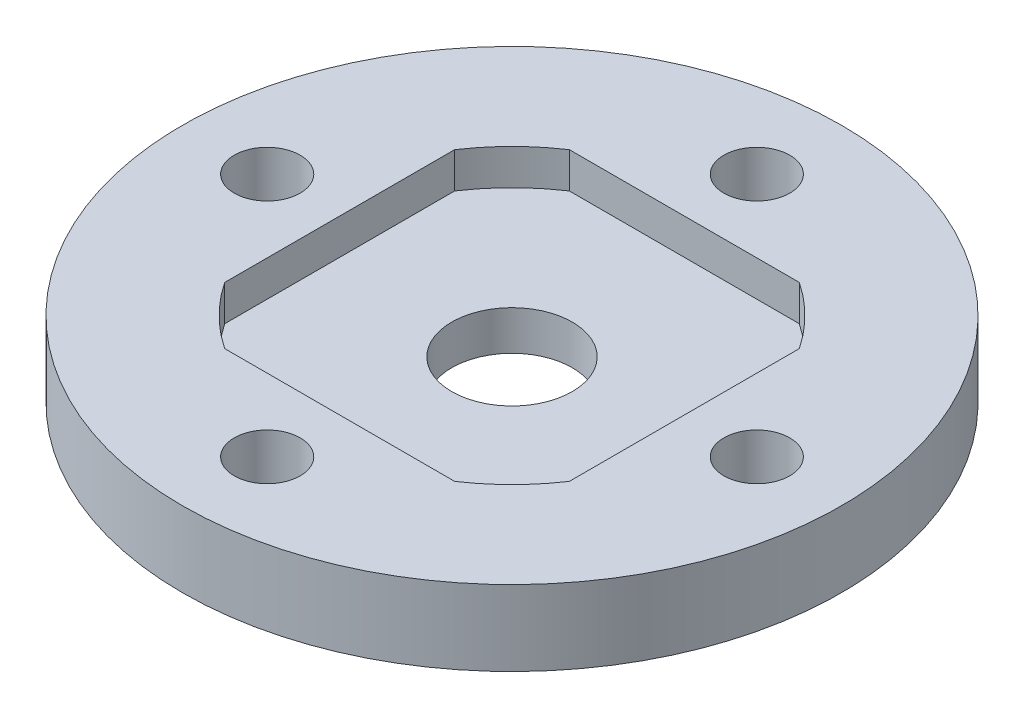
ISO-10303-21;
HEADER;
FILE_DESCRIPTION(('STEP AP214'),'2;1');
FILE_NAME('part.step','',(''),(''),'','','');
FILE_SCHEMA(('AUTOMOTIVE_DESIGN { 1 0 10303 214 1 1 1 1 }'));
ENDSEC;
DATA;
#1=APPLICATION_CONTEXT('core data for automotive mechanical design processes');
#2=APPLICATION_PROTOCOL_DEFINITION('international standard','automotive_design',2000,#1);
#3=PRODUCT_CONTEXT('',#1,'mechanical');
#4=PRODUCT('Part','Part','',(#3));
#5=PRODUCT_RELATED_PRODUCT_CATEGORY('part','',(#4));
#6=PRODUCT_DEFINITION_FORMATION('','',#4);
#7=PRODUCT_DEFINITION_CONTEXT('part definition',#1,'design');
#8=PRODUCT_DEFINITION('design','',#6,#7);
#9=PRODUCT_DEFINITION_SHAPE('','',#8);
#10=(LENGTH_UNIT() NAMED_UNIT(*) SI_UNIT(.MILLI.,.METRE.));
#11=(NAMED_UNIT(*) PLANE_ANGLE_UNIT() SI_UNIT($,.RADIAN.));
#12=(NAMED_UNIT(*) SI_UNIT($,.STERADIAN.) SOLID_ANGLE_UNIT());
#13=UNCERTAINTY_MEASURE_WITH_UNIT(LENGTH_MEASURE(1.E-05),#10,'distance_accuracy_value','');
#14=(GEOMETRIC_REPRESENTATION_CONTEXT(3) GLOBAL_UNCERTAINTY_ASSIGNED_CONTEXT((#13)) GLOBAL_UNIT_ASSIGNED_CONTEXT((#10,
#11,#12)) REPRESENTATION_CONTEXT('',''));
#15=CARTESIAN_POINT('',(0.,0.,0.));
#16=DIRECTION('',(0.,0.,1.));
#17=DIRECTION('',(1.,0.,0.));
#18=AXIS2_PLACEMENT_3D('',#15,#16,#17);
#19=CARTESIAN_POINT('',(0.106470277324355,0.,0.34151265619882));
#20=DIRECTION('',(0.,1.,0.));
#21=DIRECTION('',(0.,0.,1.));
#22=AXIS2_PLACEMENT_3D('',#19,#20,#21);
#23=CYLINDRICAL_SURFACE('',#22,3.2);
#24=CARTESIAN_POINT('',(0.106470277324355,0.,0.34151265619882));
#25=DIRECTION('',(0.,1.,0.));
#26=DIRECTION('',(0.,0.,1.));
#27=AXIS2_PLACEMENT_3D('',#24,#25,#26);
#28=CIRCLE('',#27,3.2);
#29=CARTESIAN_POINT('',(0.106470277324355,0.,3.54151265619882));
#30=VERTEX_POINT('',#29);
#31=EDGE_CURVE('E166',#30,#30,#28,.T.);
#32=ORIENTED_EDGE('',*,*,#31,.F.);
#33=EDGE_LOOP('',(#32));
#34=FACE_BOUND('',#33,.T.);
#35=CARTESIAN_POINT('',(0.106470277324355,2.1,0.34151265619882));
#36=DIRECTION('',(0.,1.,0.));
#37=DIRECTION('',(0.,0.,1.));
#38=AXIS2_PLACEMENT_3D('',#35,#36,#37);
#39=CIRCLE('',#38,3.2);
#40=CARTESIAN_POINT('',(0.106470277324355,2.1,3.54151265619882));
#41=VERTEX_POINT('',#40);
#42=EDGE_CURVE('E156',#41,#41,#39,.F.);
#43=ORIENTED_EDGE('',*,*,#42,.F.);
#44=EDGE_LOOP('',(#43));
#45=FACE_BOUND('',#44,.T.);
#46=ADVANCED_FACE('F35',(#34,#45),#23,.F.);
#47=CARTESIAN_POINT('',(0.106470277324355,4.,0.34151265619882));
#48=DIRECTION('',(0.,1.,0.));
#49=DIRECTION('',(0.,0.,1.));
#50=AXIS2_PLACEMENT_3D('',#47,#48,#49);
#51=PLANE('',#50);
#52=CARTESIAN_POINT('',(0.106470277324357,4.,0.34151265619882));
#53=DIRECTION('',(0.,1.,0.));
#54=DIRECTION('',(0.,0.,1.));
#55=AXIS2_PLACEMENT_3D('',#52,#53,#54);
#56=CIRCLE('',#55,11.);
#57=CARTESIAN_POINT('',(-9.04352972267564,4.,6.44704293619908));
#58=VERTEX_POINT('',#57);
#59=CARTESIAN_POINT('',(-5.9990600026759,4.,9.49151265619882));
#60=VERTEX_POINT('',#59);
#61=EDGE_CURVE('E50',#58,#60,#56,.T.);
#62=ORIENTED_EDGE('',*,*,#61,.F.);
#63=DIRECTION('',(0.,0.,1.));
#64=VECTOR('',#63,1.);
#65=CARTESIAN_POINT('',(-9.04352972267564,4.,-5.76401762380143));
#66=LINE('',#65,#64);
#67=CARTESIAN_POINT('',(-9.04352972267564,4.,-5.76401762380144));
#68=VERTEX_POINT('',#67);
#69=EDGE_CURVE('E152',#68,#58,#66,.T.);
#70=ORIENTED_EDGE('',*,*,#69,.F.);
#71=CARTESIAN_POINT('',(0.106470277324357,4.,0.34151265619882));
#72=DIRECTION('',(0.,1.,0.));
#73=DIRECTION('',(0.,0.,1.));
#74=AXIS2_PLACEMENT_3D('',#71,#72,#73);
#75=CIRCLE('',#74,11.);
#76=CARTESIAN_POINT('',(-5.9990600026759,4.,-8.80848734380118));
#77=VERTEX_POINT('',#76);
#78=EDGE_CURVE('E150',#77,#68,#75,.T.);
#79=ORIENTED_EDGE('',*,*,#78,.F.);
#80=DIRECTION('',(-1.,0.,0.));
#81=VECTOR('',#80,1.);
#82=CARTESIAN_POINT('',(6.21200055732461,4.,-8.80848734380118));
#83=LINE('',#82,#81);
#84=CARTESIAN_POINT('',(6.21200055732461,4.,-8.80848734380118));
#85=VERTEX_POINT('',#84);
#86=EDGE_CURVE('E110',#85,#77,#83,.T.);
#87=ORIENTED_EDGE('',*,*,#86,.F.);
#88=CARTESIAN_POINT('',(0.106470277324357,4.,0.34151265619882));
#89=DIRECTION('',(0.,1.,0.));
#90=DIRECTION('',(0.,0.,1.));
#91=AXIS2_PLACEMENT_3D('',#88,#89,#90);
#92=CIRCLE('',#91,11.);
#93=CARTESIAN_POINT('',(9.25647027732436,4.,-5.76401762380144));
#94=VERTEX_POINT('',#93);
#95=EDGE_CURVE('E146',#94,#85,#92,.T.);
#96=ORIENTED_EDGE('',*,*,#95,.F.);
#97=DIRECTION('',(0.,0.,-1.));
#98=VECTOR('',#97,1.);
#99=CARTESIAN_POINT('',(9.25647027732436,4.,-5.76401762380144));
#100=LINE('',#99,#98);
#101=CARTESIAN_POINT('',(9.25647027732436,4.,6.44704293619907));
#102=VERTEX_POINT('',#101);
#103=EDGE_CURVE('E143',#102,#94,#100,.T.);
#104=ORIENTED_EDGE('',*,*,#103,.F.);
#105=CARTESIAN_POINT('',(0.106470277324357,4.,0.34151265619882));
#106=DIRECTION('',(0.,1.,0.));
#107=DIRECTION('',(0.,0.,1.));
#108=AXIS2_PLACEMENT_3D('',#105,#106,#107);
#109=CIRCLE('',#108,11.);
#110=CARTESIAN_POINT('',(6.21200055732461,4.,9.49151265619882));
#111=VERTEX_POINT('',#110);
#112=EDGE_CURVE('E140',#111,#102,#109,.T.);
#113=ORIENTED_EDGE('',*,*,#112,.F.);
#114=DIRECTION('',(1.,0.,0.));
#115=VECTOR('',#114,1.);
#116=CARTESIAN_POINT('',(6.21200055732461,4.,9.49151265619882));
#117=LINE('',#116,#115);
#118=EDGE_CURVE('E137',#60,#111,#117,.T.);
#119=ORIENTED_EDGE('',*,*,#118,.F.);
#120=EDGE_LOOP('',(#62,#70,#79,#87,#96,#104,#113,#119));
#121=FACE_BOUND('',#120,.T.);
#122=CARTESIAN_POINT('',(-12.8935297226753,4.,0.341512656198451));
#123=DIRECTION('',(0.,1.,0.));
#124=DIRECTION('',(0.,0.,1.));
#125=AXIS2_PLACEMENT_3D('',#122,#123,#124);
#126=CIRCLE('',#125,1.75000000000059);
#127=CARTESIAN_POINT('',(-12.8935297226753,4.,2.09151265619904));
#128=VERTEX_POINT('',#127);
#129=EDGE_CURVE('E172',#128,#128,#126,.T.);
#130=ORIENTED_EDGE('',*,*,#129,.F.);
#131=EDGE_LOOP('',(#130));
#132=FACE_BOUND('',#131,.T.);
#133=CARTESIAN_POINT('',(13.1064702773247,4.,0.341512656199187));
#134=DIRECTION('',(0.,1.,0.));
#135=DIRECTION('',(0.,0.,1.));
#136=AXIS2_PLACEMENT_3D('',#133,#134,#135);
#137=CIRCLE('',#136,1.75000000000029);
#138=CARTESIAN_POINT('',(13.1064702773247,4.,2.09151265619948));
#139=VERTEX_POINT('',#138);
#140=EDGE_CURVE('E178',#139,#139,#137,.T.);
#141=ORIENTED_EDGE('',*,*,#140,.F.);
#142=EDGE_LOOP('',(#141));
#143=FACE_BOUND('',#142,.T.);
#144=CARTESIAN_POINT('',(0.106470277324355,4.,0.34151265619882));
#145=DIRECTION('',(0.,1.,0.));
#146=DIRECTION('',(0.,0.,1.));
#147=AXIS2_PLACEMENT_3D('',#144,#145,#146);
#148=CIRCLE('',#147,17.5);
#149=CARTESIAN_POINT('',(0.106470277324355,4.,17.8415126561988));
#150=VERTEX_POINT('',#149);
#151=EDGE_CURVE('E182',#150,#150,#148,.T.);
#152=ORIENTED_EDGE('',*,*,#151,.T.);
#153=EDGE_LOOP('',(#152));
#154=FACE_BOUND('',#153,.T.);
#155=CARTESIAN_POINT('',(0.106470277324355,4.,13.3415126561988));
#156=DIRECTION('',(0.,1.,0.));
#157=DIRECTION('',(0.,0.,1.));
#158=AXIS2_PLACEMENT_3D('',#155,#156,#157);
#159=CIRCLE('',#158,1.75);
#160=CARTESIAN_POINT('',(0.106470277324355,4.,15.0915126561988));
#161=VERTEX_POINT('',#160);
#162=EDGE_CURVE('E175',#161,#161,#159,.T.);
#163=ORIENTED_EDGE('',*,*,#162,.F.);
#164=EDGE_LOOP('',(#163));
#165=FACE_BOUND('',#164,.T.);
#166=CARTESIAN_POINT('',(0.106470277325091,4.,-12.6584873438012));
#167=DIRECTION('',(0.,1.,0.));
#168=DIRECTION('',(0.,0.,1.));
#169=AXIS2_PLACEMENT_3D('',#166,#167,#168);
#170=CIRCLE('',#169,1.75000000000079);
#171=CARTESIAN_POINT('',(0.106470277325091,4.,-10.9084873438004));
#172=VERTEX_POINT('',#171);
#173=EDGE_CURVE('E169',#172,#172,#170,.T.);
#174=ORIENTED_EDGE('',*,*,#173,.F.);
#175=EDGE_LOOP('',(#174));
#176=FACE_BOUND('',#175,.T.);
#177=ADVANCED_FACE('F222',(#121,#132,#143,#154,#165,#176),#51,.T.);
#178=CARTESIAN_POINT('',(0.106470277324355,0.,0.34151265619882));
#179=DIRECTION('',(0.,1.,0.));
#180=DIRECTION('',(0.,0.,1.));
#181=AXIS2_PLACEMENT_3D('',#178,#179,#180);
#182=PLANE('',#181);
#183=CARTESIAN_POINT('',(0.106470277324355,0.,13.3415126561988));
#184=DIRECTION('',(0.,1.,0.));
#185=DIRECTION('',(0.,0.,1.));
#186=AXIS2_PLACEMENT_3D('',#183,#184,#185);
#187=CIRCLE('',#186,3.14999999999999);
#188=CARTESIAN_POINT('',(0.106470277324355,0.,16.4915126561988));
#189=VERTEX_POINT('',#188);
#190=EDGE_CURVE('E198',#189,#189,#187,.T.);
#191=ORIENTED_EDGE('',*,*,#190,.T.);
#192=EDGE_LOOP('',(#191));
#193=FACE_BOUND('',#192,.T.);
#194=CARTESIAN_POINT('',(13.1064702773247,0.,0.341512656199187));
#195=DIRECTION('',(0.,1.,0.));
#196=DIRECTION('',(0.,0.,1.));
#197=AXIS2_PLACEMENT_3D('',#194,#195,#196);
#198=CIRCLE('',#197,3.15000000000028);
#199=CARTESIAN_POINT('',(13.1064702773247,0.,3.49151265619947));
#200=VERTEX_POINT('',#199);
#201=EDGE_CURVE('E195',#200,#200,#198,.T.);
#202=ORIENTED_EDGE('',*,*,#201,.T.);
#203=EDGE_LOOP('',(#202));
#204=FACE_BOUND('',#203,.T.);
#205=CARTESIAN_POINT('',(-12.8935297226753,0.,0.341512656198451));
#206=DIRECTION('',(0.,1.,0.));
#207=DIRECTION('',(0.,0.,1.));
#208=AXIS2_PLACEMENT_3D('',#205,#206,#207);
#209=CIRCLE('',#208,3.15000000000059);
#210=CARTESIAN_POINT('',(-12.8935297226753,0.,3.49151265619904));
#211=VERTEX_POINT('',#210);
#212=EDGE_CURVE('E192',#211,#211,#209,.T.);
#213=ORIENTED_EDGE('',*,*,#212,.T.);
#214=EDGE_LOOP('',(#213));
#215=FACE_BOUND('',#214,.T.);
#216=CARTESIAN_POINT('',(0.106470277325091,0.,-12.6584873438012));
#217=DIRECTION('',(0.,1.,0.));
#218=DIRECTION('',(0.,0.,1.));
#219=AXIS2_PLACEMENT_3D('',#216,#217,#218);
#220=CIRCLE('',#219,3.15000000000078);
#221=CARTESIAN_POINT('',(0.106470277325091,0.,-9.50848734380039));
#222=VERTEX_POINT('',#221);
#223=EDGE_CURVE('E185',#222,#222,#220,.T.);
#224=ORIENTED_EDGE('',*,*,#223,.T.);
#225=EDGE_LOOP('',(#224));
#226=FACE_BOUND('',#225,.T.);
#227=ORIENTED_EDGE('',*,*,#31,.T.);
#228=EDGE_LOOP('',(#227));
#229=FACE_BOUND('',#228,.T.);
#230=CARTESIAN_POINT('',(0.106470277324355,0.,0.34151265619882));
#231=DIRECTION('',(0.,1.,0.));
#232=DIRECTION('',(0.,0.,1.));
#233=AXIS2_PLACEMENT_3D('',#230,#231,#232);
#234=CIRCLE('',#233,17.5);
#235=CARTESIAN_POINT('',(0.106470277324355,0.,17.8415126561988));
#236=VERTEX_POINT('',#235);
#237=EDGE_CURVE('E181',#236,#236,#234,.T.);
#238=ORIENTED_EDGE('',*,*,#237,.F.);
#239=EDGE_LOOP('',(#238));
#240=FACE_BOUND('',#239,.T.);
#241=ADVANCED_FACE('F218',(#193,#204,#215,#226,#229,#240),#182,.F.);
#242=CARTESIAN_POINT('',(0.106470277324355,4.,0.34151265619882));
#243=DIRECTION('',(0.,-1.,0.));
#244=DIRECTION('',(0.,0.,-1.));
#245=AXIS2_PLACEMENT_3D('',#242,#243,#244);
#246=CYLINDRICAL_SURFACE('',#245,17.5);
#247=ORIENTED_EDGE('',*,*,#151,.F.);
#248=EDGE_LOOP('',(#247));
#249=FACE_BOUND('',#248,.T.);
#250=ORIENTED_EDGE('',*,*,#237,.T.);
#251=EDGE_LOOP('',(#250));
#252=FACE_BOUND('',#251,.T.);
#253=ADVANCED_FACE('F221',(#249,#252),#246,.T.);
#254=CARTESIAN_POINT('',(13.1064702773247,4.,0.341512656199187));
#255=DIRECTION('',(0.,-1.,0.));
#256=DIRECTION('',(0.,0.,-1.));
#257=AXIS2_PLACEMENT_3D('',#254,#255,#256);
#258=CYLINDRICAL_SURFACE('',#257,1.75000000000029);
#259=CARTESIAN_POINT('',(13.1064702773247,1.4,0.341512656199187));
#260=DIRECTION('',(0.,1.,0.));
#261=DIRECTION('',(0.,0.,1.));
#262=AXIS2_PLACEMENT_3D('',#259,#260,#261);
#263=CIRCLE('',#262,1.75000000000029);
#264=CARTESIAN_POINT('',(13.1064702773247,1.4,2.09151265619948));
#265=VERTEX_POINT('',#264);
#266=EDGE_CURVE('E204',#265,#265,#263,.F.);
#267=ORIENTED_EDGE('',*,*,#266,.T.);
#268=EDGE_LOOP('',(#267));
#269=FACE_BOUND('',#268,.T.);
#270=ORIENTED_EDGE('',*,*,#140,.T.);
#271=EDGE_LOOP('',(#270));
#272=FACE_BOUND('',#271,.T.);
#273=ADVANCED_FACE('F232',(#269,#272),#258,.F.);
#274=CARTESIAN_POINT('',(0.106470277324355,4.,13.3415126561988));
#275=DIRECTION('',(0.,-1.,0.));
#276=DIRECTION('',(0.,0.,-1.));
#277=AXIS2_PLACEMENT_3D('',#274,#275,#276);
#278=CYLINDRICAL_SURFACE('',#277,1.75);
#279=CARTESIAN_POINT('',(0.106470277324355,1.4,13.3415126561988));
#280=DIRECTION('',(0.,1.,0.));
#281=DIRECTION('',(0.,0.,1.));
#282=AXIS2_PLACEMENT_3D('',#279,#280,#281);
#283=CIRCLE('',#282,1.75);
#284=CARTESIAN_POINT('',(0.106470277324355,1.4,15.0915126561988));
#285=VERTEX_POINT('',#284);
#286=EDGE_CURVE('E201',#285,#285,#283,.F.);
#287=ORIENTED_EDGE('',*,*,#286,.T.);
#288=EDGE_LOOP('',(#287));
#289=FACE_BOUND('',#288,.T.);
#290=ORIENTED_EDGE('',*,*,#162,.T.);
#291=EDGE_LOOP('',(#290));
#292=FACE_BOUND('',#291,.T.);
#293=ADVANCED_FACE('F238',(#289,#292),#278,.F.);
#294=CARTESIAN_POINT('',(-12.8935297226753,4.,0.341512656198451));
#295=DIRECTION('',(0.,-1.,0.));
#296=DIRECTION('',(0.,0.,-1.));
#297=AXIS2_PLACEMENT_3D('',#294,#295,#296);
#298=CYLINDRICAL_SURFACE('',#297,1.75000000000059);
#299=CARTESIAN_POINT('',(-12.8935297226753,1.40000000000001,0.341512656198451));
#300=DIRECTION('',(0.,1.,0.));
#301=DIRECTION('',(0.,0.,1.));
#302=AXIS2_PLACEMENT_3D('',#299,#300,#301);
#303=CIRCLE('',#302,1.75000000000059);
#304=CARTESIAN_POINT('',(-12.8935297226753,1.40000000000001,2.09151265619904));
#305=VERTEX_POINT('',#304);
#306=EDGE_CURVE('E43',#305,#305,#303,.F.);
#307=ORIENTED_EDGE('',*,*,#306,.T.);
#308=EDGE_LOOP('',(#307));
#309=FACE_BOUND('',#308,.T.);
#310=ORIENTED_EDGE('',*,*,#129,.T.);
#311=EDGE_LOOP('',(#310));
#312=FACE_BOUND('',#311,.T.);
#313=ADVANCED_FACE('F209',(#309,#312),#298,.F.);
#314=CARTESIAN_POINT('',(0.106470277325091,4.,-12.6584873438012));
#315=DIRECTION('',(0.,-1.,0.));
#316=DIRECTION('',(0.,0.,-1.));
#317=AXIS2_PLACEMENT_3D('',#314,#315,#316);
#318=CYLINDRICAL_SURFACE('',#317,1.75000000000079);
#319=CARTESIAN_POINT('',(0.106470277325091,1.4,-12.6584873438012));
#320=DIRECTION('',(0.,1.,0.));
#321=DIRECTION('',(0.,0.,1.));
#322=AXIS2_PLACEMENT_3D('',#319,#320,#321);
#323=CIRCLE('',#322,1.75000000000079);
#324=CARTESIAN_POINT('',(0.106470277325091,1.4,-10.9084873438004));
#325=VERTEX_POINT('',#324);
#326=EDGE_CURVE('E11',#325,#325,#323,.F.);
#327=ORIENTED_EDGE('',*,*,#326,.T.);
#328=EDGE_LOOP('',(#327));
#329=FACE_BOUND('',#328,.T.);
#330=ORIENTED_EDGE('',*,*,#173,.T.);
#331=EDGE_LOOP('',(#330));
#332=FACE_BOUND('',#331,.T.);
#333=ADVANCED_FACE('F256',(#329,#332),#318,.F.);
#334=CARTESIAN_POINT('',(0.106470277324357,2.1,0.34151265619882));
#335=DIRECTION('',(0.,1.,0.));
#336=DIRECTION('',(0.,0.,1.));
#337=AXIS2_PLACEMENT_3D('',#334,#335,#336);
#338=PLANE('',#337);
#339=CARTESIAN_POINT('',(0.106470277324357,2.1,0.34151265619882));
#340=DIRECTION('',(0.,1.,0.));
#341=DIRECTION('',(0.,0.,1.));
#342=AXIS2_PLACEMENT_3D('',#339,#340,#341);
#343=CIRCLE('',#342,11.);
#344=CARTESIAN_POINT('',(-9.04352972267564,2.1,6.44704293619908));
#345=VERTEX_POINT('',#344);
#346=CARTESIAN_POINT('',(-5.9990600026759,2.1,9.49151265619882));
#347=VERTEX_POINT('',#346);
#348=EDGE_CURVE('E154',#345,#347,#343,.T.);
#349=ORIENTED_EDGE('',*,*,#348,.T.);
#350=DIRECTION('',(1.,0.,0.));
#351=VECTOR('',#350,1.);
#352=CARTESIAN_POINT('',(6.21200055732461,2.1,9.49151265619882));
#353=LINE('',#352,#351);
#354=CARTESIAN_POINT('',(6.21200055732461,2.1,9.49151265619882));
#355=VERTEX_POINT('',#354);
#356=EDGE_CURVE('E443',#347,#355,#353,.T.);
#357=ORIENTED_EDGE('',*,*,#356,.T.);
#358=CARTESIAN_POINT('',(0.106470277324357,2.1,0.34151265619882));
#359=DIRECTION('',(0.,1.,0.));
#360=DIRECTION('',(0.,0.,1.));
#361=AXIS2_PLACEMENT_3D('',#358,#359,#360);
#362=CIRCLE('',#361,11.);
#363=CARTESIAN_POINT('',(9.25647027732436,2.1,6.44704293619907));
#364=VERTEX_POINT('',#363);
#365=EDGE_CURVE('E445',#355,#364,#362,.T.);
#366=ORIENTED_EDGE('',*,*,#365,.T.);
#367=DIRECTION('',(0.,0.,-1.));
#368=VECTOR('',#367,1.);
#369=CARTESIAN_POINT('',(9.25647027732436,2.1,-5.76401762380144));
#370=LINE('',#369,#368);
#371=CARTESIAN_POINT('',(9.25647027732436,2.1,-5.76401762380144));
#372=VERTEX_POINT('',#371);
#373=EDGE_CURVE('E131',#364,#372,#370,.T.);
#374=ORIENTED_EDGE('',*,*,#373,.T.);
#375=CARTESIAN_POINT('',(0.106470277324357,2.1,0.34151265619882));
#376=DIRECTION('',(0.,1.,0.));
#377=DIRECTION('',(0.,0.,1.));
#378=AXIS2_PLACEMENT_3D('',#375,#376,#377);
#379=CIRCLE('',#378,11.);
#380=CARTESIAN_POINT('',(6.21200055732461,2.1,-8.80848734380118));
#381=VERTEX_POINT('',#380);
#382=EDGE_CURVE('E129',#372,#381,#379,.T.);
#383=ORIENTED_EDGE('',*,*,#382,.T.);
#384=DIRECTION('',(-1.,0.,0.));
#385=VECTOR('',#384,1.);
#386=CARTESIAN_POINT('',(6.21200055732461,2.1,-8.80848734380118));
#387=LINE('',#386,#385);
#388=CARTESIAN_POINT('',(-5.9990600026759,2.1,-8.80848734380118));
#389=VERTEX_POINT('',#388);
#390=EDGE_CURVE('E107',#381,#389,#387,.T.);
#391=ORIENTED_EDGE('',*,*,#390,.T.);
#392=CARTESIAN_POINT('',(0.106470277324357,2.1,0.34151265619882));
#393=DIRECTION('',(0.,1.,0.));
#394=DIRECTION('',(0.,0.,1.));
#395=AXIS2_PLACEMENT_3D('',#392,#393,#394);
#396=CIRCLE('',#395,11.);
#397=CARTESIAN_POINT('',(-9.04352972267564,2.1,-5.76401762380144));
#398=VERTEX_POINT('',#397);
#399=EDGE_CURVE('E118',#389,#398,#396,.T.);
#400=ORIENTED_EDGE('',*,*,#399,.T.);
#401=DIRECTION('',(0.,0.,1.));
#402=VECTOR('',#401,1.);
#403=CARTESIAN_POINT('',(-9.04352972267564,2.1,-5.76401762380143));
#404=LINE('',#403,#402);
#405=EDGE_CURVE('E122',#398,#345,#404,.T.);
#406=ORIENTED_EDGE('',*,*,#405,.T.);
#407=EDGE_LOOP('',(#349,#357,#366,#374,#383,#391,#400,#406));
#408=FACE_BOUND('',#407,.T.);
#409=ORIENTED_EDGE('',*,*,#42,.T.);
#410=EDGE_LOOP('',(#409));
#411=FACE_BOUND('',#410,.T.);
#412=ADVANCED_FACE('F125',(#408,#411),#338,.T.);
#413=CARTESIAN_POINT('',(0.106470277324357,2.1,0.34151265619882));
#414=DIRECTION('',(0.,1.,0.));
#415=DIRECTION('',(0.,0.,1.));
#416=AXIS2_PLACEMENT_3D('',#413,#414,#415);
#417=CYLINDRICAL_SURFACE('',#416,11.);
#418=ORIENTED_EDGE('',*,*,#61,.T.);
#419=DIRECTION('',(0.,1.,0.));
#420=VECTOR('',#419,1.);
#421=CARTESIAN_POINT('',(-5.9990600026759,2.1,9.49151265619882));
#422=LINE('',#421,#420);
#423=EDGE_CURVE('E86',#347,#60,#422,.T.);
#424=ORIENTED_EDGE('',*,*,#423,.F.);
#425=ORIENTED_EDGE('',*,*,#348,.F.);
#426=DIRECTION('',(0.,1.,0.));
#427=VECTOR('',#426,1.);
#428=CARTESIAN_POINT('',(-9.04352972267564,2.1,6.44704293619908));
#429=LINE('',#428,#427);
#430=EDGE_CURVE('E58',#345,#58,#429,.T.);
#431=ORIENTED_EDGE('',*,*,#430,.T.);
#432=EDGE_LOOP('',(#418,#424,#425,#431));
#433=FACE_BOUND('',#432,.T.);
#434=ADVANCED_FACE('F254',(#433),#417,.F.);
#435=CARTESIAN_POINT('',(-9.04352972267564,2.1,-5.76401762380143));
#436=DIRECTION('',(-1.,0.,0.));
#437=DIRECTION('',(0.,0.,1.));
#438=AXIS2_PLACEMENT_3D('',#435,#436,#437);
#439=PLANE('',#438);
#440=ORIENTED_EDGE('',*,*,#69,.T.);
#441=ORIENTED_EDGE('',*,*,#430,.F.);
#442=ORIENTED_EDGE('',*,*,#405,.F.);
#443=DIRECTION('',(0.,1.,0.));
#444=VECTOR('',#443,1.);
#445=CARTESIAN_POINT('',(-9.04352972267564,2.1,-5.76401762380144));
#446=LINE('',#445,#444);
#447=EDGE_CURVE('E114',#398,#68,#446,.T.);
#448=ORIENTED_EDGE('',*,*,#447,.T.);
#449=EDGE_LOOP('',(#440,#441,#442,#448));
#450=FACE_BOUND('',#449,.T.);
#451=ADVANCED_FACE('F365',(#450),#439,.F.);
#452=CARTESIAN_POINT('',(0.106470277324357,2.1,0.34151265619882));
#453=DIRECTION('',(0.,1.,0.));
#454=DIRECTION('',(0.,0.,1.));
#455=AXIS2_PLACEMENT_3D('',#452,#453,#454);
#456=CYLINDRICAL_SURFACE('',#455,11.);
#457=ORIENTED_EDGE('',*,*,#78,.T.);
#458=ORIENTED_EDGE('',*,*,#447,.F.);
#459=ORIENTED_EDGE('',*,*,#399,.F.);
#460=DIRECTION('',(0.,1.,0.));
#461=VECTOR('',#460,1.);
#462=CARTESIAN_POINT('',(-5.9990600026759,2.1,-8.80848734380118));
#463=LINE('',#462,#461);
#464=EDGE_CURVE('E103',#389,#77,#463,.T.);
#465=ORIENTED_EDGE('',*,*,#464,.T.);
#466=EDGE_LOOP('',(#457,#458,#459,#465));
#467=FACE_BOUND('',#466,.T.);
#468=ADVANCED_FACE('F119',(#467),#456,.F.);
#469=CARTESIAN_POINT('',(6.21200055732461,2.1,-8.80848734380118));
#470=DIRECTION('',(0.,0.,-1.));
#471=DIRECTION('',(-1.,0.,0.));
#472=AXIS2_PLACEMENT_3D('',#469,#470,#471);
#473=PLANE('',#472);
#474=ORIENTED_EDGE('',*,*,#86,.T.);
#475=ORIENTED_EDGE('',*,*,#464,.F.);
#476=ORIENTED_EDGE('',*,*,#390,.F.);
#477=DIRECTION('',(0.,1.,0.));
#478=VECTOR('',#477,1.);
#479=CARTESIAN_POINT('',(6.21200055732461,2.1,-8.80848734380118));
#480=LINE('',#479,#478);
#481=EDGE_CURVE('E115',#381,#85,#480,.T.);
#482=ORIENTED_EDGE('',*,*,#481,.T.);
#483=EDGE_LOOP('',(#474,#475,#476,#482));
#484=FACE_BOUND('',#483,.T.);
#485=ADVANCED_FACE('F105',(#484),#473,.F.);
#486=CARTESIAN_POINT('',(0.106470277324357,2.1,0.34151265619882));
#487=DIRECTION('',(0.,1.,0.));
#488=DIRECTION('',(0.,0.,1.));
#489=AXIS2_PLACEMENT_3D('',#486,#487,#488);
#490=CYLINDRICAL_SURFACE('',#489,11.);
#491=ORIENTED_EDGE('',*,*,#95,.T.);
#492=ORIENTED_EDGE('',*,*,#481,.F.);
#493=ORIENTED_EDGE('',*,*,#382,.F.);
#494=DIRECTION('',(0.,1.,0.));
#495=VECTOR('',#494,1.);
#496=CARTESIAN_POINT('',(9.25647027732436,2.1,-5.76401762380144));
#497=LINE('',#496,#495);
#498=EDGE_CURVE('E159',#372,#94,#497,.T.);
#499=ORIENTED_EDGE('',*,*,#498,.T.);
#500=EDGE_LOOP('',(#491,#492,#493,#499));
#501=FACE_BOUND('',#500,.T.);
#502=ADVANCED_FACE('F341',(#501),#490,.F.);
#503=CARTESIAN_POINT('',(9.25647027732436,2.1,-5.76401762380144));
#504=DIRECTION('',(1.,0.,0.));
#505=DIRECTION('',(0.,0.,-1.));
#506=AXIS2_PLACEMENT_3D('',#503,#504,#505);
#507=PLANE('',#506);
#508=ORIENTED_EDGE('',*,*,#103,.T.);
#509=ORIENTED_EDGE('',*,*,#498,.F.);
#510=ORIENTED_EDGE('',*,*,#373,.F.);
#511=DIRECTION('',(0.,1.,0.));
#512=VECTOR('',#511,1.);
#513=CARTESIAN_POINT('',(9.25647027732436,2.1,6.44704293619907));
#514=LINE('',#513,#512);
#515=EDGE_CURVE('E161',#364,#102,#514,.T.);
#516=ORIENTED_EDGE('',*,*,#515,.T.);
#517=EDGE_LOOP('',(#508,#509,#510,#516));
#518=FACE_BOUND('',#517,.T.);
#519=ADVANCED_FACE('F332',(#518),#507,.F.);
#520=CARTESIAN_POINT('',(0.106470277324357,2.1,0.34151265619882));
#521=DIRECTION('',(0.,1.,0.));
#522=DIRECTION('',(0.,0.,1.));
#523=AXIS2_PLACEMENT_3D('',#520,#521,#522);
#524=CYLINDRICAL_SURFACE('',#523,11.);
#525=ORIENTED_EDGE('',*,*,#112,.T.);
#526=ORIENTED_EDGE('',*,*,#515,.F.);
#527=ORIENTED_EDGE('',*,*,#365,.F.);
#528=DIRECTION('',(0.,1.,0.));
#529=VECTOR('',#528,1.);
#530=CARTESIAN_POINT('',(6.21200055732461,2.1,9.49151265619882));
#531=LINE('',#530,#529);
#532=EDGE_CURVE('E163',#355,#111,#531,.T.);
#533=ORIENTED_EDGE('',*,*,#532,.T.);
#534=EDGE_LOOP('',(#525,#526,#527,#533));
#535=FACE_BOUND('',#534,.T.);
#536=ADVANCED_FACE('F323',(#535),#524,.F.);
#537=CARTESIAN_POINT('',(6.21200055732461,2.1,9.49151265619882));
#538=DIRECTION('',(0.,0.,1.));
#539=DIRECTION('',(1.,0.,0.));
#540=AXIS2_PLACEMENT_3D('',#537,#538,#539);
#541=PLANE('',#540);
#542=ORIENTED_EDGE('',*,*,#118,.T.);
#543=ORIENTED_EDGE('',*,*,#532,.F.);
#544=ORIENTED_EDGE('',*,*,#356,.F.);
#545=ORIENTED_EDGE('',*,*,#423,.T.);
#546=EDGE_LOOP('',(#542,#543,#544,#545));
#547=FACE_BOUND('',#546,.T.);
#548=ADVANCED_FACE('F277',(#547),#541,.F.);
#549=CARTESIAN_POINT('',(0.106470277324355,0.,13.3415126561988));
#550=DIRECTION('',(0.,-1.,0.));
#551=DIRECTION('',(0.,0.,-1.));
#552=AXIS2_PLACEMENT_3D('',#549,#550,#551);
#553=CONICAL_SURFACE('',#552,3.14999999999999,0.785398163397443);
#554=ORIENTED_EDGE('',*,*,#286,.F.);
#555=EDGE_LOOP('',(#554));
#556=FACE_BOUND('',#555,.T.);
#557=ORIENTED_EDGE('',*,*,#190,.F.);
#558=EDGE_LOOP('',(#557));
#559=FACE_BOUND('',#558,.T.);
#560=ADVANCED_FACE('F274',(#556,#559),#553,.F.);
#561=CARTESIAN_POINT('',(13.1064702773247,0.,0.341512656199187));
#562=DIRECTION('',(0.,-1.,0.));
#563=DIRECTION('',(0.,0.,-1.));
#564=AXIS2_PLACEMENT_3D('',#561,#562,#563);
#565=CONICAL_SURFACE('',#564,3.15000000000028,0.785398163397446);
#566=ORIENTED_EDGE('',*,*,#266,.F.);
#567=EDGE_LOOP('',(#566));
#568=FACE_BOUND('',#567,.T.);
#569=ORIENTED_EDGE('',*,*,#201,.F.);
#570=EDGE_LOOP('',(#569));
#571=FACE_BOUND('',#570,.T.);
#572=ADVANCED_FACE('F215',(#568,#571),#565,.F.);
#573=CARTESIAN_POINT('',(-12.8935297226753,0.,0.341512656198451));
#574=DIRECTION('',(0.,-1.,0.));
#575=DIRECTION('',(0.,0.,-1.));
#576=AXIS2_PLACEMENT_3D('',#573,#574,#575);
#577=CONICAL_SURFACE('',#576,3.15000000000059,0.785398163397446);
#578=ORIENTED_EDGE('',*,*,#306,.F.);
#579=EDGE_LOOP('',(#578));
#580=FACE_BOUND('',#579,.T.);
#581=ORIENTED_EDGE('',*,*,#212,.F.);
#582=EDGE_LOOP('',(#581));
#583=FACE_BOUND('',#582,.T.);
#584=ADVANCED_FACE('F212',(#580,#583),#577,.F.);
#585=CARTESIAN_POINT('',(0.106470277325091,0.,-12.6584873438012));
#586=DIRECTION('',(0.,-1.,0.));
#587=DIRECTION('',(0.,0.,-1.));
#588=AXIS2_PLACEMENT_3D('',#585,#586,#587);
#589=CONICAL_SURFACE('',#588,3.15000000000078,0.785398163397446);
#590=ORIENTED_EDGE('',*,*,#326,.F.);
#591=EDGE_LOOP('',(#590));
#592=FACE_BOUND('',#591,.T.);
#593=ORIENTED_EDGE('',*,*,#223,.F.);
#594=EDGE_LOOP('',(#593));
#595=FACE_BOUND('',#594,.T.);
#596=ADVANCED_FACE('F37',(#592,#595),#589,.F.);
#597=CLOSED_SHELL('',(#46,#177,#241,#253,#273,#293,#313,#333,#412,#434,#451,#468,#485,#502,#519,
#536,#548,#560,#572,#584,#596));
#598=MANIFOLD_SOLID_BREP('B2',#597);
#599=ADVANCED_BREP_SHAPE_REPRESENTATION('',(#18,#598),#14);
#600=SHAPE_DEFINITION_REPRESENTATION(#9,#599);
ENDSEC;
END-ISO-10303-21;
